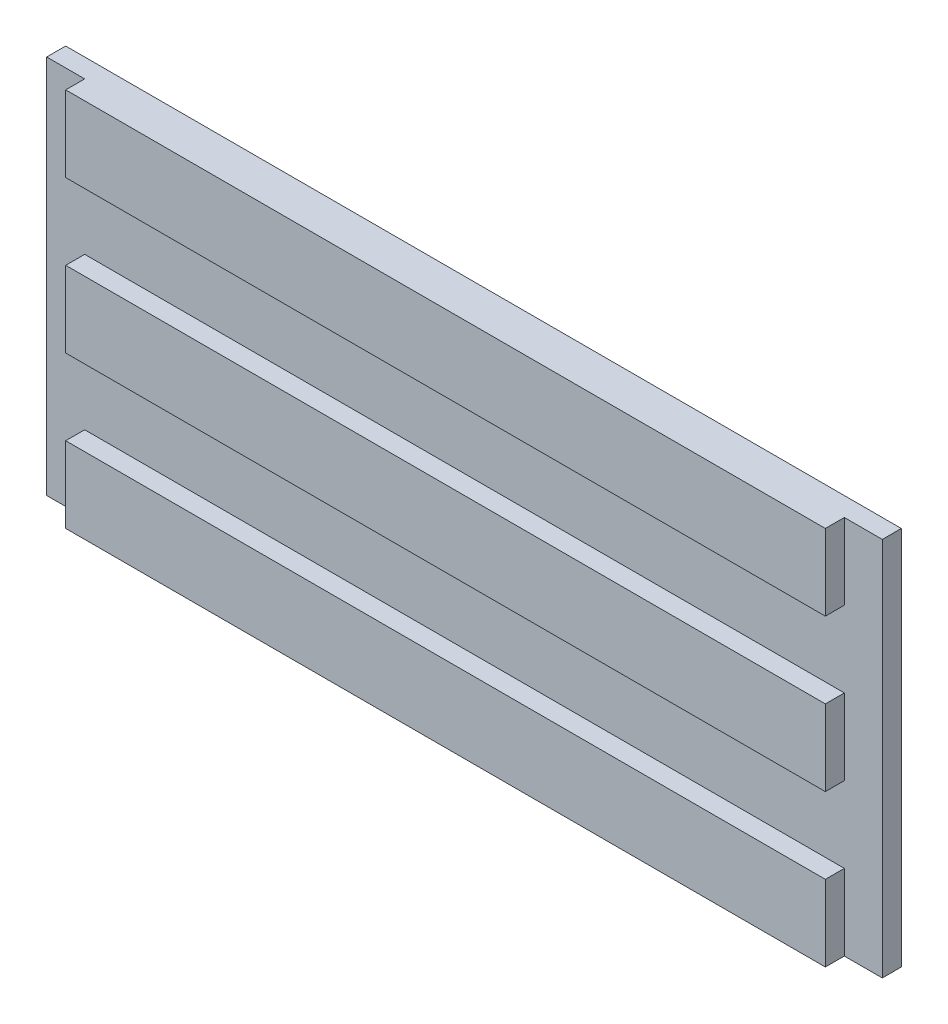
ISO-10303-21;
HEADER;
FILE_DESCRIPTION(('STEP AP214'),'2;1');
FILE_NAME('part.step','',(''),(''),'','','');
FILE_SCHEMA(('AUTOMOTIVE_DESIGN { 1 0 10303 214 1 1 1 1 }'));
ENDSEC;
DATA;
#1=APPLICATION_CONTEXT('core data for automotive mechanical design processes');
#2=APPLICATION_PROTOCOL_DEFINITION('international standard','automotive_design',2000,#1);
#3=PRODUCT_CONTEXT('',#1,'mechanical');
#4=PRODUCT('Part','Part','',(#3));
#5=PRODUCT_RELATED_PRODUCT_CATEGORY('part','',(#4));
#6=PRODUCT_DEFINITION_FORMATION('','',#4);
#7=PRODUCT_DEFINITION_CONTEXT('part definition',#1,'design');
#8=PRODUCT_DEFINITION('design','',#6,#7);
#9=PRODUCT_DEFINITION_SHAPE('','',#8);
#10=(LENGTH_UNIT() NAMED_UNIT(*) SI_UNIT(.MILLI.,.METRE.));
#11=(NAMED_UNIT(*) PLANE_ANGLE_UNIT() SI_UNIT($,.RADIAN.));
#12=(NAMED_UNIT(*) SI_UNIT($,.STERADIAN.) SOLID_ANGLE_UNIT());
#13=UNCERTAINTY_MEASURE_WITH_UNIT(LENGTH_MEASURE(1.E-05),#10,'distance_accuracy_value','');
#14=(GEOMETRIC_REPRESENTATION_CONTEXT(3) GLOBAL_UNCERTAINTY_ASSIGNED_CONTEXT((#13)) GLOBAL_UNIT_ASSIGNED_CONTEXT((#10,
#11,#12)) REPRESENTATION_CONTEXT('',''));
#15=CARTESIAN_POINT('',(0.,0.,0.));
#16=DIRECTION('',(0.,0.,1.));
#17=DIRECTION('',(1.,0.,0.));
#18=AXIS2_PLACEMENT_3D('',#15,#16,#17);
#19=CARTESIAN_POINT('',(10.,3.,1.25));
#20=DIRECTION('',(0.,1.,0.));
#21=DIRECTION('',(0.,0.,1.));
#22=AXIS2_PLACEMENT_3D('',#19,#20,#21);
#23=PLANE('',#22);
#24=DIRECTION('',(-1.,0.,0.));
#25=VECTOR('',#24,1.);
#26=CARTESIAN_POINT('',(-10.,3.,1.25));
#27=LINE('',#26,#25);
#28=CARTESIAN_POINT('',(10.,3.,1.25));
#29=VERTEX_POINT('',#28);
#30=CARTESIAN_POINT('',(-10.,3.,1.25));
#31=VERTEX_POINT('',#30);
#32=EDGE_CURVE('E126',#29,#31,#27,.T.);
#33=ORIENTED_EDGE('',*,*,#32,.T.);
#34=DIRECTION('',(0.,0.,-1.));
#35=VECTOR('',#34,1.);
#36=CARTESIAN_POINT('',(-10.,3.,0.75));
#37=LINE('',#36,#35);
#38=CARTESIAN_POINT('',(-10.,3.,0.75));
#39=VERTEX_POINT('',#38);
#40=EDGE_CURVE('E134',#31,#39,#37,.T.);
#41=ORIENTED_EDGE('',*,*,#40,.T.);
#42=DIRECTION('',(-1.,0.,0.));
#43=VECTOR('',#42,1.);
#44=CARTESIAN_POINT('',(10.,3.,0.75));
#45=LINE('',#44,#43);
#46=CARTESIAN_POINT('',(10.,3.,0.75));
#47=VERTEX_POINT('',#46);
#48=EDGE_CURVE('E129',#39,#47,#45,.F.);
#49=ORIENTED_EDGE('',*,*,#48,.T.);
#50=DIRECTION('',(0.,0.,1.));
#51=VECTOR('',#50,1.);
#52=CARTESIAN_POINT('',(10.,3.,1.25));
#53=LINE('',#52,#51);
#54=EDGE_CURVE('E132',#29,#47,#53,.F.);
#55=ORIENTED_EDGE('',*,*,#54,.F.);
#56=EDGE_LOOP('',(#33,#41,#49,#55));
#57=FACE_BOUND('',#56,.T.);
#58=ADVANCED_FACE('F16',(#57),#23,.F.);
#59=CARTESIAN_POINT('',(-10.,3.,0.75));
#60=DIRECTION('',(1.,0.,0.));
#61=DIRECTION('',(0.,0.,-1.));
#62=AXIS2_PLACEMENT_3D('',#59,#60,#61);
#63=PLANE('',#62);
#64=ORIENTED_EDGE('',*,*,#40,.F.);
#65=DIRECTION('',(0.,1.,0.));
#66=VECTOR('',#65,1.);
#67=CARTESIAN_POINT('',(-10.,5.,1.25));
#68=LINE('',#67,#66);
#69=CARTESIAN_POINT('',(-10.0000000000002,5.,1.25000000000001));
#70=VERTEX_POINT('',#69);
#71=EDGE_CURVE('E173',#31,#70,#68,.T.);
#72=ORIENTED_EDGE('',*,*,#71,.T.);
#73=DIRECTION('',(0.,0.,-1.));
#74=VECTOR('',#73,1.);
#75=CARTESIAN_POINT('',(-10.,5.,0.75));
#76=LINE('',#75,#74);
#77=CARTESIAN_POINT('',(-10.,5.,0.75));
#78=VERTEX_POINT('',#77);
#79=EDGE_CURVE('E153',#78,#70,#76,.F.);
#80=ORIENTED_EDGE('',*,*,#79,.F.);
#81=DIRECTION('',(0.,1.,0.));
#82=VECTOR('',#81,1.);
#83=CARTESIAN_POINT('',(-10.,3.,0.75));
#84=LINE('',#83,#82);
#85=EDGE_CURVE('E179',#78,#39,#84,.F.);
#86=ORIENTED_EDGE('',*,*,#85,.T.);
#87=EDGE_LOOP('',(#64,#72,#80,#86));
#88=FACE_BOUND('',#87,.T.);
#89=ADVANCED_FACE('F336',(#88),#63,.F.);
#90=CARTESIAN_POINT('',(-10.,1.,0.75));
#91=DIRECTION('',(0.,-1.,0.));
#92=DIRECTION('',(0.,0.,-1.));
#93=AXIS2_PLACEMENT_3D('',#90,#91,#92);
#94=PLANE('',#93);
#95=DIRECTION('',(0.,0.,-1.));
#96=VECTOR('',#95,1.);
#97=CARTESIAN_POINT('',(-10.,1.,0.75));
#98=LINE('',#97,#96);
#99=CARTESIAN_POINT('',(-9.99999999999851,1.,1.24999999999998));
#100=VERTEX_POINT('',#99);
#101=CARTESIAN_POINT('',(-10.,1.,0.75));
#102=VERTEX_POINT('',#101);
#103=EDGE_CURVE('E160',#100,#102,#98,.T.);
#104=ORIENTED_EDGE('',*,*,#103,.F.);
#105=DIRECTION('',(-1.,0.,0.));
#106=VECTOR('',#105,1.);
#107=CARTESIAN_POINT('',(10.,1.,1.25));
#108=LINE('',#107,#106);
#109=CARTESIAN_POINT('',(10.,1.,1.25));
#110=VERTEX_POINT('',#109);
#111=EDGE_CURVE('E154',#100,#110,#108,.F.);
#112=ORIENTED_EDGE('',*,*,#111,.T.);
#113=DIRECTION('',(0.,0.,-1.));
#114=VECTOR('',#113,1.);
#115=CARTESIAN_POINT('',(10.,1.,0.75));
#116=LINE('',#115,#114);
#117=CARTESIAN_POINT('',(9.99999999999963,1.,0.750000000000005));
#118=VERTEX_POINT('',#117);
#119=EDGE_CURVE('E19',#118,#110,#116,.F.);
#120=ORIENTED_EDGE('',*,*,#119,.F.);
#121=DIRECTION('',(-1.,0.,0.));
#122=VECTOR('',#121,1.);
#123=CARTESIAN_POINT('',(-10.,1.,0.75));
#124=LINE('',#123,#122);
#125=EDGE_CURVE('E181',#118,#102,#124,.T.);
#126=ORIENTED_EDGE('',*,*,#125,.T.);
#127=EDGE_LOOP('',(#104,#112,#120,#126));
#128=FACE_BOUND('',#127,.T.);
#129=ADVANCED_FACE('F333',(#128),#94,.F.);
#130=CARTESIAN_POINT('',(-10.,1.,1.25));
#131=DIRECTION('',(0.,0.,-1.));
#132=DIRECTION('',(-1.,0.,0.));
#133=AXIS2_PLACEMENT_3D('',#130,#131,#132);
#134=PLANE('',#133);
#135=DIRECTION('',(1.,0.,0.));
#136=VECTOR('',#135,1.);
#137=CARTESIAN_POINT('',(10.,-1.,1.25));
#138=LINE('',#137,#136);
#139=CARTESIAN_POINT('',(-10.,-0.999999999999999,1.25));
#140=VERTEX_POINT('',#139);
#141=CARTESIAN_POINT('',(10.,-1.,1.25));
#142=VERTEX_POINT('',#141);
#143=EDGE_CURVE('E164',#140,#142,#138,.T.);
#144=ORIENTED_EDGE('',*,*,#143,.T.);
#145=DIRECTION('',(0.,1.,0.));
#146=VECTOR('',#145,1.);
#147=CARTESIAN_POINT('',(10.,1.,1.25));
#148=LINE('',#147,#146);
#149=EDGE_CURVE('E139',#142,#110,#148,.T.);
#150=ORIENTED_EDGE('',*,*,#149,.T.);
#151=ORIENTED_EDGE('',*,*,#111,.F.);
#152=DIRECTION('',(0.,1.,0.));
#153=VECTOR('',#152,1.);
#154=CARTESIAN_POINT('',(-10.,1.,1.25));
#155=LINE('',#154,#153);
#156=EDGE_CURVE('E184',#100,#140,#155,.F.);
#157=ORIENTED_EDGE('',*,*,#156,.T.);
#158=EDGE_LOOP('',(#144,#150,#151,#157));
#159=FACE_BOUND('',#158,.T.);
#160=ADVANCED_FACE('F330',(#159),#134,.F.);
#161=CARTESIAN_POINT('',(10.,5.,1.25));
#162=DIRECTION('',(-1.,0.,0.));
#163=DIRECTION('',(0.,0.,1.));
#164=AXIS2_PLACEMENT_3D('',#161,#162,#163);
#165=PLANE('',#164);
#166=DIRECTION('',(0.,1.,0.));
#167=VECTOR('',#166,1.);
#168=CARTESIAN_POINT('',(10.,5.,1.25));
#169=LINE('',#168,#167);
#170=CARTESIAN_POINT('',(10.,5.,1.25));
#171=VERTEX_POINT('',#170);
#172=EDGE_CURVE('E152',#171,#29,#169,.F.);
#173=ORIENTED_EDGE('',*,*,#172,.T.);
#174=ORIENTED_EDGE('',*,*,#54,.T.);
#175=DIRECTION('',(0.,1.,0.));
#176=VECTOR('',#175,1.);
#177=CARTESIAN_POINT('',(10.,5.,0.75));
#178=LINE('',#177,#176);
#179=CARTESIAN_POINT('',(10.,5.,0.75));
#180=VERTEX_POINT('',#179);
#181=EDGE_CURVE('E138',#47,#180,#178,.T.);
#182=ORIENTED_EDGE('',*,*,#181,.T.);
#183=DIRECTION('',(0.,0.,1.));
#184=VECTOR('',#183,1.);
#185=CARTESIAN_POINT('',(10.,5.,1.25));
#186=LINE('',#185,#184);
#187=EDGE_CURVE('E170',#171,#180,#186,.F.);
#188=ORIENTED_EDGE('',*,*,#187,.F.);
#189=EDGE_LOOP('',(#173,#174,#182,#188));
#190=FACE_BOUND('',#189,.T.);
#191=ADVANCED_FACE('F150',(#190),#165,.F.);
#192=CARTESIAN_POINT('',(-10.,-1.,1.25));
#193=DIRECTION('',(0.,1.,0.));
#194=DIRECTION('',(0.,0.,1.));
#195=AXIS2_PLACEMENT_3D('',#192,#193,#194);
#196=PLANE('',#195);
#197=DIRECTION('',(-1.,0.,0.));
#198=VECTOR('',#197,1.);
#199=CARTESIAN_POINT('',(10.,-1.,0.75));
#200=LINE('',#199,#198);
#201=CARTESIAN_POINT('',(-10.,-1.,0.75));
#202=VERTEX_POINT('',#201);
#203=CARTESIAN_POINT('',(10.,-1.,0.75));
#204=VERTEX_POINT('',#203);
#205=EDGE_CURVE('E202',#202,#204,#200,.F.);
#206=ORIENTED_EDGE('',*,*,#205,.T.);
#207=DIRECTION('',(0.,0.,1.));
#208=VECTOR('',#207,1.);
#209=CARTESIAN_POINT('',(10.,-1.,1.25));
#210=LINE('',#209,#208);
#211=EDGE_CURVE('E162',#142,#204,#210,.F.);
#212=ORIENTED_EDGE('',*,*,#211,.F.);
#213=ORIENTED_EDGE('',*,*,#143,.F.);
#214=DIRECTION('',(0.,0.,-1.));
#215=VECTOR('',#214,1.);
#216=CARTESIAN_POINT('',(-10.,-1.,0.75));
#217=LINE('',#216,#215);
#218=EDGE_CURVE('E196',#140,#202,#217,.T.);
#219=ORIENTED_EDGE('',*,*,#218,.T.);
#220=EDGE_LOOP('',(#206,#212,#213,#219));
#221=FACE_BOUND('',#220,.T.);
#222=ADVANCED_FACE('F323',(#221),#196,.F.);
#223=CARTESIAN_POINT('',(10.,-1.,1.25));
#224=DIRECTION('',(-1.,0.,0.));
#225=DIRECTION('',(0.,0.,1.));
#226=AXIS2_PLACEMENT_3D('',#223,#224,#225);
#227=PLANE('',#226);
#228=DIRECTION('',(0.,1.,0.));
#229=VECTOR('',#228,1.);
#230=CARTESIAN_POINT('',(10.,5.,0.75));
#231=LINE('',#230,#229);
#232=EDGE_CURVE('E205',#204,#118,#231,.T.);
#233=ORIENTED_EDGE('',*,*,#232,.T.);
#234=ORIENTED_EDGE('',*,*,#119,.T.);
#235=ORIENTED_EDGE('',*,*,#149,.F.);
#236=ORIENTED_EDGE('',*,*,#211,.T.);
#237=EDGE_LOOP('',(#233,#234,#235,#236));
#238=FACE_BOUND('',#237,.T.);
#239=ADVANCED_FACE('F319',(#238),#227,.F.);
#240=CARTESIAN_POINT('',(10.,5.,1.25));
#241=DIRECTION('',(0.,0.,-1.));
#242=DIRECTION('',(-1.,0.,0.));
#243=AXIS2_PLACEMENT_3D('',#240,#241,#242);
#244=PLANE('',#243);
#245=DIRECTION('',(1.,0.,0.));
#246=VECTOR('',#245,1.);
#247=CARTESIAN_POINT('',(10.,5.,1.25));
#248=LINE('',#247,#246);
#249=EDGE_CURVE('E208',#171,#70,#248,.F.);
#250=ORIENTED_EDGE('',*,*,#249,.T.);
#251=ORIENTED_EDGE('',*,*,#71,.F.);
#252=ORIENTED_EDGE('',*,*,#32,.F.);
#253=ORIENTED_EDGE('',*,*,#172,.F.);
#254=EDGE_LOOP('',(#250,#251,#252,#253));
#255=FACE_BOUND('',#254,.T.);
#256=ADVANCED_FACE('F315',(#255),#244,.F.);
#257=CARTESIAN_POINT('',(-10.,-3.,0.75));
#258=DIRECTION('',(0.,-1.,0.));
#259=DIRECTION('',(0.,0.,-1.));
#260=AXIS2_PLACEMENT_3D('',#257,#258,#259);
#261=PLANE('',#260);
#262=DIRECTION('',(0.,0.,-1.));
#263=VECTOR('',#262,1.);
#264=CARTESIAN_POINT('',(-10.,-3.,0.75));
#265=LINE('',#264,#263);
#266=CARTESIAN_POINT('',(-10.,-3.,0.75));
#267=VERTEX_POINT('',#266);
#268=CARTESIAN_POINT('',(-9.99999999999851,-3.,1.24999999999998));
#269=VERTEX_POINT('',#268);
#270=EDGE_CURVE('E211',#267,#269,#265,.F.);
#271=ORIENTED_EDGE('',*,*,#270,.T.);
#272=DIRECTION('',(-1.,0.,0.));
#273=VECTOR('',#272,1.);
#274=CARTESIAN_POINT('',(10.,-3.,1.25));
#275=LINE('',#274,#273);
#276=CARTESIAN_POINT('',(10.,-3.,1.25));
#277=VERTEX_POINT('',#276);
#278=EDGE_CURVE('E187',#269,#277,#275,.F.);
#279=ORIENTED_EDGE('',*,*,#278,.T.);
#280=DIRECTION('',(0.,0.,1.));
#281=VECTOR('',#280,1.);
#282=CARTESIAN_POINT('',(10.,-3.,1.25));
#283=LINE('',#282,#281);
#284=CARTESIAN_POINT('',(9.99999999999965,-3.,0.750000000000005));
#285=VERTEX_POINT('',#284);
#286=EDGE_CURVE('E190',#277,#285,#283,.F.);
#287=ORIENTED_EDGE('',*,*,#286,.T.);
#288=DIRECTION('',(-1.,0.,0.));
#289=VECTOR('',#288,1.);
#290=CARTESIAN_POINT('',(10.,-3.,0.75));
#291=LINE('',#290,#289);
#292=EDGE_CURVE('E217',#285,#267,#291,.T.);
#293=ORIENTED_EDGE('',*,*,#292,.T.);
#294=EDGE_LOOP('',(#271,#279,#287,#293));
#295=FACE_BOUND('',#294,.T.);
#296=ADVANCED_FACE('F311',(#295),#261,.F.);
#297=CARTESIAN_POINT('',(-10.,-1.,0.75));
#298=DIRECTION('',(1.,0.,0.));
#299=DIRECTION('',(0.,0.,-1.));
#300=AXIS2_PLACEMENT_3D('',#297,#298,#299);
#301=PLANE('',#300);
#302=ORIENTED_EDGE('',*,*,#218,.F.);
#303=ORIENTED_EDGE('',*,*,#156,.F.);
#304=ORIENTED_EDGE('',*,*,#103,.T.);
#305=DIRECTION('',(0.,1.,0.));
#306=VECTOR('',#305,1.);
#307=CARTESIAN_POINT('',(-10.,-1.,0.75));
#308=LINE('',#307,#306);
#309=EDGE_CURVE('E220',#102,#202,#308,.F.);
#310=ORIENTED_EDGE('',*,*,#309,.T.);
#311=EDGE_LOOP('',(#302,#303,#304,#310));
#312=FACE_BOUND('',#311,.T.);
#313=ADVANCED_FACE('F308',(#312),#301,.F.);
#314=CARTESIAN_POINT('',(-10.,-3.,1.25));
#315=DIRECTION('',(0.,0.,-1.));
#316=DIRECTION('',(-1.,0.,0.));
#317=AXIS2_PLACEMENT_3D('',#314,#315,#316);
#318=PLANE('',#317);
#319=DIRECTION('',(1.,0.,0.));
#320=VECTOR('',#319,1.);
#321=CARTESIAN_POINT('',(-10.,-5.,1.25));
#322=LINE('',#321,#320);
#323=CARTESIAN_POINT('',(-10.,-5.,1.25));
#324=VERTEX_POINT('',#323);
#325=CARTESIAN_POINT('',(9.99999999999991,-5.,1.25));
#326=VERTEX_POINT('',#325);
#327=EDGE_CURVE('E223',#324,#326,#322,.T.);
#328=ORIENTED_EDGE('',*,*,#327,.T.);
#329=DIRECTION('',(0.,1.,0.));
#330=VECTOR('',#329,1.);
#331=CARTESIAN_POINT('',(10.,-3.,1.25));
#332=LINE('',#331,#330);
#333=EDGE_CURVE('E192',#326,#277,#332,.T.);
#334=ORIENTED_EDGE('',*,*,#333,.T.);
#335=ORIENTED_EDGE('',*,*,#278,.F.);
#336=DIRECTION('',(0.,1.,0.));
#337=VECTOR('',#336,1.);
#338=CARTESIAN_POINT('',(-10.,-3.,1.25));
#339=LINE('',#338,#337);
#340=EDGE_CURVE('E214',#269,#324,#339,.F.);
#341=ORIENTED_EDGE('',*,*,#340,.T.);
#342=EDGE_LOOP('',(#328,#334,#335,#341));
#343=FACE_BOUND('',#342,.T.);
#344=ADVANCED_FACE('F276',(#343),#318,.F.);
#345=CARTESIAN_POINT('',(10.,-5.,1.25));
#346=DIRECTION('',(-1.,0.,0.));
#347=DIRECTION('',(0.,0.,1.));
#348=AXIS2_PLACEMENT_3D('',#345,#346,#347);
#349=PLANE('',#348);
#350=DIRECTION('',(0.,1.,0.));
#351=VECTOR('',#350,1.);
#352=CARTESIAN_POINT('',(10.,-5.,0.75));
#353=LINE('',#352,#351);
#354=CARTESIAN_POINT('',(10.,-5.,0.75));
#355=VERTEX_POINT('',#354);
#356=EDGE_CURVE('E229',#355,#285,#353,.T.);
#357=ORIENTED_EDGE('',*,*,#356,.T.);
#358=ORIENTED_EDGE('',*,*,#286,.F.);
#359=ORIENTED_EDGE('',*,*,#333,.F.);
#360=DIRECTION('',(0.,0.,1.));
#361=VECTOR('',#360,1.);
#362=CARTESIAN_POINT('',(10.,-5.,1.25));
#363=LINE('',#362,#361);
#364=EDGE_CURVE('E199',#355,#326,#363,.T.);
#365=ORIENTED_EDGE('',*,*,#364,.F.);
#366=EDGE_LOOP('',(#357,#358,#359,#365));
#367=FACE_BOUND('',#366,.T.);
#368=ADVANCED_FACE('F274',(#367),#349,.F.);
#369=CARTESIAN_POINT('',(-10.,-5.,0.75));
#370=DIRECTION('',(1.,0.,0.));
#371=DIRECTION('',(0.,0.,-1.));
#372=AXIS2_PLACEMENT_3D('',#369,#370,#371);
#373=PLANE('',#372);
#374=DIRECTION('',(0.,0.,-1.));
#375=VECTOR('',#374,1.);
#376=CARTESIAN_POINT('',(-10.,-5.,0.75));
#377=LINE('',#376,#375);
#378=CARTESIAN_POINT('',(-9.99999999999962,-5.,0.750000000000005));
#379=VERTEX_POINT('',#378);
#380=EDGE_CURVE('E232',#324,#379,#377,.T.);
#381=ORIENTED_EDGE('',*,*,#380,.F.);
#382=ORIENTED_EDGE('',*,*,#340,.F.);
#383=ORIENTED_EDGE('',*,*,#270,.F.);
#384=DIRECTION('',(0.,1.,0.));
#385=VECTOR('',#384,1.);
#386=CARTESIAN_POINT('',(-10.,-3.,0.75));
#387=LINE('',#386,#385);
#388=EDGE_CURVE('E234',#267,#379,#387,.F.);
#389=ORIENTED_EDGE('',*,*,#388,.T.);
#390=EDGE_LOOP('',(#381,#382,#383,#389));
#391=FACE_BOUND('',#390,.T.);
#392=ADVANCED_FACE('F280',(#391),#373,.F.);
#393=CARTESIAN_POINT('',(-11.,5.,0.75));
#394=DIRECTION('',(0.,0.,-1.));
#395=DIRECTION('',(-1.,0.,0.));
#396=AXIS2_PLACEMENT_3D('',#393,#394,#395);
#397=PLANE('',#396);
#398=ORIENTED_EDGE('',*,*,#125,.F.);
#399=ORIENTED_EDGE('',*,*,#232,.F.);
#400=ORIENTED_EDGE('',*,*,#205,.F.);
#401=ORIENTED_EDGE('',*,*,#309,.F.);
#402=EDGE_LOOP('',(#398,#399,#400,#401));
#403=FACE_BOUND('',#402,.T.);
#404=DIRECTION('',(1.,0.,0.));
#405=VECTOR('',#404,1.);
#406=CARTESIAN_POINT('',(-10.,-5.,0.75));
#407=LINE('',#406,#405);
#408=CARTESIAN_POINT('',(-11.0000000000004,-4.99999999999985,0.750000000000001));
#409=VERTEX_POINT('',#408);
#410=EDGE_CURVE('E241',#409,#379,#407,.T.);
#411=ORIENTED_EDGE('',*,*,#410,.T.);
#412=ORIENTED_EDGE('',*,*,#388,.F.);
#413=ORIENTED_EDGE('',*,*,#292,.F.);
#414=ORIENTED_EDGE('',*,*,#356,.F.);
#415=DIRECTION('',(-1.,0.,0.));
#416=VECTOR('',#415,1.);
#417=CARTESIAN_POINT('',(11.,-5.,0.75));
#418=LINE('',#417,#416);
#419=CARTESIAN_POINT('',(11.,-5.,0.75));
#420=VERTEX_POINT('',#419);
#421=EDGE_CURVE('E226',#420,#355,#418,.T.);
#422=ORIENTED_EDGE('',*,*,#421,.F.);
#423=DIRECTION('',(0.,1.,0.));
#424=VECTOR('',#423,1.);
#425=CARTESIAN_POINT('',(11.,5.,0.75));
#426=LINE('',#425,#424);
#427=CARTESIAN_POINT('',(11.,5.00000000000004,0.75));
#428=VERTEX_POINT('',#427);
#429=EDGE_CURVE('E239',#420,#428,#426,.T.);
#430=ORIENTED_EDGE('',*,*,#429,.T.);
#431=DIRECTION('',(-1.,0.,0.));
#432=VECTOR('',#431,1.);
#433=CARTESIAN_POINT('',(11.,5.,0.75));
#434=LINE('',#433,#432);
#435=EDGE_CURVE('E145',#180,#428,#434,.F.);
#436=ORIENTED_EDGE('',*,*,#435,.F.);
#437=ORIENTED_EDGE('',*,*,#181,.F.);
#438=ORIENTED_EDGE('',*,*,#48,.F.);
#439=ORIENTED_EDGE('',*,*,#85,.F.);
#440=DIRECTION('',(-1.,0.,0.));
#441=VECTOR('',#440,1.);
#442=CARTESIAN_POINT('',(-10.,5.,0.75));
#443=LINE('',#442,#441);
#444=CARTESIAN_POINT('',(-10.9999999999998,4.99999999999998,0.749999999999998));
#445=VERTEX_POINT('',#444);
#446=EDGE_CURVE('E176',#445,#78,#443,.F.);
#447=ORIENTED_EDGE('',*,*,#446,.F.);
#448=DIRECTION('',(0.,1.,0.));
#449=VECTOR('',#448,1.);
#450=CARTESIAN_POINT('',(-11.,5.,0.75));
#451=LINE('',#450,#449);
#452=EDGE_CURVE('E247',#445,#409,#451,.F.);
#453=ORIENTED_EDGE('',*,*,#452,.T.);
#454=EDGE_LOOP('',(#411,#412,#413,#414,#422,#430,#436,#437,#438,#439,#447,#453));
#455=FACE_BOUND('',#454,.T.);
#456=ADVANCED_FACE('F143',(#403,#455),#397,.F.);
#457=CARTESIAN_POINT('',(11.,-5.,0.75));
#458=DIRECTION('',(-1.,0.,0.));
#459=DIRECTION('',(0.,0.,1.));
#460=AXIS2_PLACEMENT_3D('',#457,#458,#459);
#461=PLANE('',#460);
#462=DIRECTION('',(0.,1.,0.));
#463=VECTOR('',#462,1.);
#464=CARTESIAN_POINT('',(11.,-5.,0.25));
#465=LINE('',#464,#463);
#466=CARTESIAN_POINT('',(10.9999999996047,-5.,0.250000000009198));
#467=VERTEX_POINT('',#466);
#468=CARTESIAN_POINT('',(11.0000000000933,5.,0.249999999997823));
#469=VERTEX_POINT('',#468);
#470=EDGE_CURVE('E250',#467,#469,#465,.T.);
#471=ORIENTED_EDGE('',*,*,#470,.T.);
#472=DIRECTION('',(0.,0.,1.));
#473=VECTOR('',#472,1.);
#474=CARTESIAN_POINT('',(11.,5.,0.75));
#475=LINE('',#474,#473);
#476=EDGE_CURVE('E237',#428,#469,#475,.F.);
#477=ORIENTED_EDGE('',*,*,#476,.F.);
#478=ORIENTED_EDGE('',*,*,#429,.F.);
#479=DIRECTION('',(0.,0.,1.));
#480=VECTOR('',#479,1.);
#481=CARTESIAN_POINT('',(11.,-5.,0.75));
#482=LINE('',#481,#480);
#483=EDGE_CURVE('E243',#467,#420,#482,.T.);
#484=ORIENTED_EDGE('',*,*,#483,.F.);
#485=EDGE_LOOP('',(#471,#477,#478,#484));
#486=FACE_BOUND('',#485,.T.);
#487=ADVANCED_FACE('F269',(#486),#461,.F.);
#488=CARTESIAN_POINT('',(-11.,5.,0.25));
#489=DIRECTION('',(0.,-1.,0.));
#490=DIRECTION('',(0.,0.,-1.));
#491=AXIS2_PLACEMENT_3D('',#488,#489,#490);
#492=PLANE('',#491);
#493=DIRECTION('',(0.,0.,-1.));
#494=VECTOR('',#493,1.);
#495=CARTESIAN_POINT('',(-11.,5.,0.25));
#496=LINE('',#495,#494);
#497=CARTESIAN_POINT('',(-11.,4.99999999999992,0.250000000000002));
#498=VERTEX_POINT('',#497);
#499=EDGE_CURVE('E33',#498,#445,#496,.F.);
#500=ORIENTED_EDGE('',*,*,#499,.T.);
#501=ORIENTED_EDGE('',*,*,#446,.T.);
#502=ORIENTED_EDGE('',*,*,#79,.T.);
#503=ORIENTED_EDGE('',*,*,#249,.F.);
#504=ORIENTED_EDGE('',*,*,#187,.T.);
#505=ORIENTED_EDGE('',*,*,#435,.T.);
#506=ORIENTED_EDGE('',*,*,#476,.T.);
#507=DIRECTION('',(1.,0.,0.));
#508=VECTOR('',#507,1.);
#509=CARTESIAN_POINT('',(11.,5.,0.25));
#510=LINE('',#509,#508);
#511=EDGE_CURVE('E253',#469,#498,#510,.F.);
#512=ORIENTED_EDGE('',*,*,#511,.T.);
#513=EDGE_LOOP('',(#500,#501,#502,#503,#504,#505,#506,#512));
#514=FACE_BOUND('',#513,.T.);
#515=ADVANCED_FACE('F291',(#514),#492,.F.);
#516=CARTESIAN_POINT('',(-11.,-5.,0.75));
#517=DIRECTION('',(0.,1.,0.));
#518=DIRECTION('',(0.,0.,1.));
#519=AXIS2_PLACEMENT_3D('',#516,#517,#518);
#520=PLANE('',#519);
#521=DIRECTION('',(1.,0.,0.));
#522=VECTOR('',#521,1.);
#523=CARTESIAN_POINT('',(-11.,-5.,0.25));
#524=LINE('',#523,#522);
#525=CARTESIAN_POINT('',(-11.,-5.,0.25));
#526=VERTEX_POINT('',#525);
#527=EDGE_CURVE('E25',#526,#467,#524,.T.);
#528=ORIENTED_EDGE('',*,*,#527,.T.);
#529=ORIENTED_EDGE('',*,*,#483,.T.);
#530=ORIENTED_EDGE('',*,*,#421,.T.);
#531=ORIENTED_EDGE('',*,*,#364,.T.);
#532=ORIENTED_EDGE('',*,*,#327,.F.);
#533=ORIENTED_EDGE('',*,*,#380,.T.);
#534=ORIENTED_EDGE('',*,*,#410,.F.);
#535=DIRECTION('',(0.,0.,-1.));
#536=VECTOR('',#535,1.);
#537=CARTESIAN_POINT('',(-11.,-5.,0.25));
#538=LINE('',#537,#536);
#539=EDGE_CURVE('E255',#409,#526,#538,.T.);
#540=ORIENTED_EDGE('',*,*,#539,.T.);
#541=EDGE_LOOP('',(#528,#529,#530,#531,#532,#533,#534,#540));
#542=FACE_BOUND('',#541,.T.);
#543=ADVANCED_FACE('F260',(#542),#520,.F.);
#544=CARTESIAN_POINT('',(-11.,-5.,0.25));
#545=DIRECTION('',(1.,0.,0.));
#546=DIRECTION('',(0.,0.,-1.));
#547=AXIS2_PLACEMENT_3D('',#544,#545,#546);
#548=PLANE('',#547);
#549=ORIENTED_EDGE('',*,*,#539,.F.);
#550=ORIENTED_EDGE('',*,*,#452,.F.);
#551=ORIENTED_EDGE('',*,*,#499,.F.);
#552=DIRECTION('',(0.,1.,0.));
#553=VECTOR('',#552,1.);
#554=CARTESIAN_POINT('',(-11.,-5.,0.25));
#555=LINE('',#554,#553);
#556=EDGE_CURVE('E10',#498,#526,#555,.F.);
#557=ORIENTED_EDGE('',*,*,#556,.T.);
#558=EDGE_LOOP('',(#549,#550,#551,#557));
#559=FACE_BOUND('',#558,.T.);
#560=ADVANCED_FACE('F282',(#559),#548,.F.);
#561=CARTESIAN_POINT('',(-11.,-5.,0.25));
#562=DIRECTION('',(0.,0.,1.));
#563=DIRECTION('',(1.,0.,0.));
#564=AXIS2_PLACEMENT_3D('',#561,#562,#563);
#565=PLANE('',#564);
#566=ORIENTED_EDGE('',*,*,#556,.F.);
#567=ORIENTED_EDGE('',*,*,#511,.F.);
#568=ORIENTED_EDGE('',*,*,#470,.F.);
#569=ORIENTED_EDGE('',*,*,#527,.F.);
#570=EDGE_LOOP('',(#566,#567,#568,#569));
#571=FACE_BOUND('',#570,.T.);
#572=ADVANCED_FACE('F265',(#571),#565,.F.);
#573=CLOSED_SHELL('',(#58,#89,#129,#160,#191,#222,#239,#256,#296,#313,#344,#368,#392,#456,#487,
#515,#543,#560,#572));
#574=MANIFOLD_SOLID_BREP('B1',#573);
#575=ADVANCED_BREP_SHAPE_REPRESENTATION('',(#18,#574),#14);
#576=SHAPE_DEFINITION_REPRESENTATION(#9,#575);
ENDSEC;
END-ISO-10303-21;
